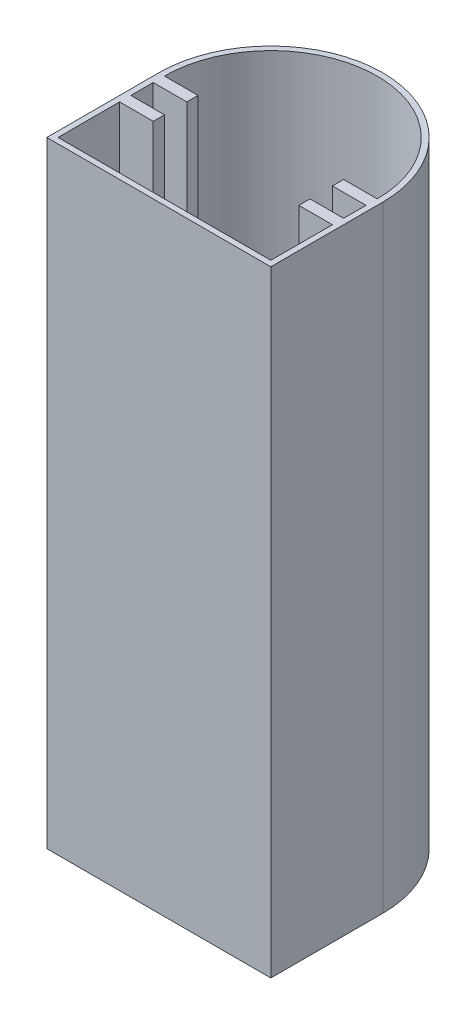
ISO-10303-21;
HEADER;
FILE_DESCRIPTION(('STEP AP214'),'2;1');
FILE_NAME('part.step','',(''),(''),'','','');
FILE_SCHEMA(('AUTOMOTIVE_DESIGN { 1 0 10303 214 1 1 1 1 }'));
ENDSEC;
DATA;
#1=APPLICATION_CONTEXT('core data for automotive mechanical design processes');
#2=APPLICATION_PROTOCOL_DEFINITION('international standard','automotive_design',2000,#1);
#3=PRODUCT_CONTEXT('',#1,'mechanical');
#4=PRODUCT('Part','Part','',(#3));
#5=PRODUCT_RELATED_PRODUCT_CATEGORY('part','',(#4));
#6=PRODUCT_DEFINITION_FORMATION('','',#4);
#7=PRODUCT_DEFINITION_CONTEXT('part definition',#1,'design');
#8=PRODUCT_DEFINITION('design','',#6,#7);
#9=PRODUCT_DEFINITION_SHAPE('','',#8);
#10=(LENGTH_UNIT() NAMED_UNIT(*) SI_UNIT(.MILLI.,.METRE.));
#11=(NAMED_UNIT(*) PLANE_ANGLE_UNIT() SI_UNIT($,.RADIAN.));
#12=(NAMED_UNIT(*) SI_UNIT($,.STERADIAN.) SOLID_ANGLE_UNIT());
#13=UNCERTAINTY_MEASURE_WITH_UNIT(LENGTH_MEASURE(1.E-05),#10,'distance_accuracy_value','');
#14=(GEOMETRIC_REPRESENTATION_CONTEXT(3) GLOBAL_UNCERTAINTY_ASSIGNED_CONTEXT((#13)) GLOBAL_UNIT_ASSIGNED_CONTEXT((#10,
#11,#12)) REPRESENTATION_CONTEXT('',''));
#15=CARTESIAN_POINT('',(0.,0.,0.));
#16=DIRECTION('',(0.,0.,1.));
#17=DIRECTION('',(1.,0.,0.));
#18=AXIS2_PLACEMENT_3D('',#15,#16,#17);
#19=CARTESIAN_POINT('',(-38.8830935251799,110.,1.70773381294964));
#20=DIRECTION('',(0.,0.,-1.));
#21=DIRECTION('',(-1.,0.,0.));
#22=AXIS2_PLACEMENT_3D('',#19,#20,#21);
#23=PLANE('',#22);
#24=DIRECTION('',(1.,0.,0.));
#25=VECTOR('',#24,1.);
#26=CARTESIAN_POINT('',(-38.8830935251799,0.,1.70773381294964));
#27=LINE('',#26,#25);
#28=CARTESIAN_POINT('',(-38.8830935251799,0.,1.70773381294964));
#29=VERTEX_POINT('',#28);
#30=CARTESIAN_POINT('',(1.11690647482014,0.,1.70773381294964));
#31=VERTEX_POINT('',#30);
#32=EDGE_CURVE('E313',#29,#31,#27,.T.);
#33=ORIENTED_EDGE('',*,*,#32,.T.);
#34=DIRECTION('',(0.,-1.,0.));
#35=VECTOR('',#34,1.);
#36=CARTESIAN_POINT('',(1.11690647482014,110.,1.70773381294964));
#37=LINE('',#36,#35);
#38=CARTESIAN_POINT('',(1.11690647482014,110.,1.70773381294964));
#39=VERTEX_POINT('',#38);
#40=EDGE_CURVE('E11',#39,#31,#37,.T.);
#41=ORIENTED_EDGE('',*,*,#40,.F.);
#42=DIRECTION('',(1.,0.,0.));
#43=VECTOR('',#42,1.);
#44=CARTESIAN_POINT('',(-38.8830935251799,110.,1.70773381294964));
#45=LINE('',#44,#43);
#46=CARTESIAN_POINT('',(-38.8830935251799,110.,1.70773381294964));
#47=VERTEX_POINT('',#46);
#48=EDGE_CURVE('E345',#47,#39,#45,.T.);
#49=ORIENTED_EDGE('',*,*,#48,.F.);
#50=DIRECTION('',(0.,-1.,0.));
#51=VECTOR('',#50,1.);
#52=CARTESIAN_POINT('',(-38.8830935251799,110.,1.70773381294964));
#53=LINE('',#52,#51);
#54=EDGE_CURVE('E59',#47,#29,#53,.T.);
#55=ORIENTED_EDGE('',*,*,#54,.T.);
#56=EDGE_LOOP('',(#33,#41,#49,#55));
#57=FACE_BOUND('',#56,.T.);
#58=ADVANCED_FACE('F35',(#57),#23,.F.);
#59=CARTESIAN_POINT('',(1.11690647482014,110.,1.70773381294964));
#60=DIRECTION('',(-1.,0.,0.));
#61=DIRECTION('',(0.,0.,1.));
#62=AXIS2_PLACEMENT_3D('',#59,#60,#61);
#63=PLANE('',#62);
#64=DIRECTION('',(0.,0.,-1.));
#65=VECTOR('',#64,1.);
#66=CARTESIAN_POINT('',(1.11690647482014,0.,1.70773381294964));
#67=LINE('',#66,#65);
#68=CARTESIAN_POINT('',(1.11690647482014,0.,-18.2922661870504));
#69=VERTEX_POINT('',#68);
#70=EDGE_CURVE('E354',#31,#69,#67,.T.);
#71=ORIENTED_EDGE('',*,*,#70,.T.);
#72=DIRECTION('',(0.,-1.,0.));
#73=VECTOR('',#72,1.);
#74=CARTESIAN_POINT('',(1.11690647482014,110.,-18.2922661870504));
#75=LINE('',#74,#73);
#76=CARTESIAN_POINT('',(1.11690647482014,110.,-18.2922661870504));
#77=VERTEX_POINT('',#76);
#78=EDGE_CURVE('E43',#77,#69,#75,.T.);
#79=ORIENTED_EDGE('',*,*,#78,.F.);
#80=DIRECTION('',(0.,0.,-1.));
#81=VECTOR('',#80,1.);
#82=CARTESIAN_POINT('',(1.11690647482014,110.,1.70773381294964));
#83=LINE('',#82,#81);
#84=EDGE_CURVE('E85',#39,#77,#83,.T.);
#85=ORIENTED_EDGE('',*,*,#84,.F.);
#86=ORIENTED_EDGE('',*,*,#40,.T.);
#87=EDGE_LOOP('',(#71,#79,#85,#86));
#88=FACE_BOUND('',#87,.T.);
#89=ADVANCED_FACE('F377',(#88),#63,.F.);
#90=CARTESIAN_POINT('',(-18.8830935251799,110.,-18.2922661870504));
#91=DIRECTION('',(0.,-1.,0.));
#92=DIRECTION('',(0.,0.,-1.));
#93=AXIS2_PLACEMENT_3D('',#90,#91,#92);
#94=CYLINDRICAL_SURFACE('',#93,20.);
#95=CARTESIAN_POINT('',(-18.8830935251799,0.,-18.2922661870504));
#96=DIRECTION('',(0.,1.,0.));
#97=DIRECTION('',(0.,0.,1.));
#98=AXIS2_PLACEMENT_3D('',#95,#96,#97);
#99=CIRCLE('',#98,20.);
#100=CARTESIAN_POINT('',(-38.8830935251799,0.,-18.2922661870504));
#101=VERTEX_POINT('',#100);
#102=EDGE_CURVE('E356',#69,#101,#99,.T.);
#103=ORIENTED_EDGE('',*,*,#102,.T.);
#104=DIRECTION('',(0.,-1.,0.));
#105=VECTOR('',#104,1.);
#106=CARTESIAN_POINT('',(-38.8830935251799,110.,-18.2922661870504));
#107=LINE('',#106,#105);
#108=CARTESIAN_POINT('',(-38.8830935251799,110.,-18.2922661870504));
#109=VERTEX_POINT('',#108);
#110=EDGE_CURVE('E362',#109,#101,#107,.T.);
#111=ORIENTED_EDGE('',*,*,#110,.F.);
#112=CARTESIAN_POINT('',(-18.8830935251799,110.,-18.2922661870504));
#113=DIRECTION('',(0.,1.,0.));
#114=DIRECTION('',(0.,0.,1.));
#115=AXIS2_PLACEMENT_3D('',#112,#113,#114);
#116=CIRCLE('',#115,20.);
#117=EDGE_CURVE('E349',#77,#109,#116,.T.);
#118=ORIENTED_EDGE('',*,*,#117,.F.);
#119=ORIENTED_EDGE('',*,*,#78,.T.);
#120=EDGE_LOOP('',(#103,#111,#118,#119));
#121=FACE_BOUND('',#120,.T.);
#122=ADVANCED_FACE('F368',(#121),#94,.T.);
#123=CARTESIAN_POINT('',(-38.8830935251799,110.,1.70773381294964));
#124=DIRECTION('',(-1.,0.,0.));
#125=DIRECTION('',(0.,0.,1.));
#126=AXIS2_PLACEMENT_3D('',#123,#124,#125);
#127=PLANE('',#126);
#128=CARTESIAN_POINT('',(-38.8830935251799,55.,-4.95893285371703));
#129=DIRECTION('',(-1.,0.,0.));
#130=DIRECTION('',(0.,0.,1.));
#131=AXIS2_PLACEMENT_3D('',#128,#129,#130);
#132=CIRCLE('',#131,2.87500000000001);
#133=CARTESIAN_POINT('',(-38.8830935251799,55.,-2.08393285371702));
#134=VERTEX_POINT('',#133);
#135=EDGE_CURVE('E219',#134,#134,#132,.T.);
#136=ORIENTED_EDGE('',*,*,#135,.F.);
#137=EDGE_LOOP('',(#136));
#138=FACE_BOUND('',#137,.T.);
#139=DIRECTION('',(0.,0.,-1.));
#140=VECTOR('',#139,1.);
#141=CARTESIAN_POINT('',(-38.8830935251799,0.,1.70773381294964));
#142=LINE('',#141,#140);
#143=EDGE_CURVE('E347',#29,#101,#142,.T.);
#144=ORIENTED_EDGE('',*,*,#143,.F.);
#145=ORIENTED_EDGE('',*,*,#54,.F.);
#146=DIRECTION('',(0.,0.,-1.));
#147=VECTOR('',#146,1.);
#148=CARTESIAN_POINT('',(-38.8830935251799,110.,1.70773381294964));
#149=LINE('',#148,#147);
#150=EDGE_CURVE('E351',#47,#109,#149,.T.);
#151=ORIENTED_EDGE('',*,*,#150,.T.);
#152=ORIENTED_EDGE('',*,*,#110,.T.);
#153=EDGE_LOOP('',(#144,#145,#151,#152));
#154=FACE_BOUND('',#153,.T.);
#155=ADVANCED_FACE('F372',(#138,#154),#127,.T.);
#156=CARTESIAN_POINT('',(-18.8830935251799,110.,-18.2922661870504));
#157=DIRECTION('',(0.,1.,0.));
#158=DIRECTION('',(0.,0.,1.));
#159=AXIS2_PLACEMENT_3D('',#156,#157,#158);
#160=PLANE('',#159);
#161=CARTESIAN_POINT('',(-18.8830935251799,110.,-18.2922661870504));
#162=DIRECTION('',(0.,1.,0.));
#163=DIRECTION('',(0.,0.,1.));
#164=AXIS2_PLACEMENT_3D('',#161,#162,#163);
#165=CIRCLE('',#164,19.);
#166=CARTESIAN_POINT('',(0.116906474820141,110.,-18.2922661870504));
#167=VERTEX_POINT('',#166);
#168=CARTESIAN_POINT('',(-37.8830935251799,110.,-18.2922661870504));
#169=VERTEX_POINT('',#168);
#170=EDGE_CURVE('E50',#167,#169,#165,.T.);
#171=ORIENTED_EDGE('',*,*,#170,.F.);
#172=DIRECTION('',(1.,0.,0.));
#173=VECTOR('',#172,1.);
#174=CARTESIAN_POINT('',(0.116906474820141,110.,-18.2922661870504));
#175=LINE('',#174,#173);
#176=CARTESIAN_POINT('',(-5.88309352517986,110.,-18.2922661870504));
#177=VERTEX_POINT('',#176);
#178=EDGE_CURVE('E213',#177,#167,#175,.T.);
#179=ORIENTED_EDGE('',*,*,#178,.F.);
#180=DIRECTION('',(0.,0.,-1.));
#181=VECTOR('',#180,1.);
#182=CARTESIAN_POINT('',(-5.88309352517986,110.,-18.2922661870504));
#183=LINE('',#182,#181);
#184=CARTESIAN_POINT('',(-5.88309352517985,110.,-16.2922661870504));
#185=VERTEX_POINT('',#184);
#186=EDGE_CURVE('E216',#185,#177,#183,.T.);
#187=ORIENTED_EDGE('',*,*,#186,.F.);
#188=DIRECTION('',(-1.,0.,0.));
#189=VECTOR('',#188,1.);
#190=CARTESIAN_POINT('',(-5.88309352517985,110.,-16.2922661870504));
#191=LINE('',#190,#189);
#192=CARTESIAN_POINT('',(0.116906474820142,110.,-16.2922661870504));
#193=VERTEX_POINT('',#192);
#194=EDGE_CURVE('E306',#193,#185,#191,.T.);
#195=ORIENTED_EDGE('',*,*,#194,.F.);
#196=DIRECTION('',(0.,0.,-1.));
#197=VECTOR('',#196,1.);
#198=CARTESIAN_POINT('',(0.116906474820142,110.,-16.2922661870504));
#199=LINE('',#198,#197);
#200=CARTESIAN_POINT('',(0.116906474820143,110.,-12.2922661870504));
#201=VERTEX_POINT('',#200);
#202=EDGE_CURVE('E303',#201,#193,#199,.T.);
#203=ORIENTED_EDGE('',*,*,#202,.F.);
#204=DIRECTION('',(1.,0.,0.));
#205=VECTOR('',#204,1.);
#206=CARTESIAN_POINT('',(0.116906474820143,110.,-12.2922661870504));
#207=LINE('',#206,#205);
#208=CARTESIAN_POINT('',(-5.88309352517986,110.,-12.2922661870504));
#209=VERTEX_POINT('',#208);
#210=EDGE_CURVE('E300',#209,#201,#207,.T.);
#211=ORIENTED_EDGE('',*,*,#210,.F.);
#212=DIRECTION('',(0.,0.,-1.));
#213=VECTOR('',#212,1.);
#214=CARTESIAN_POINT('',(-5.88309352517986,110.,-12.2922661870504));
#215=LINE('',#214,#213);
#216=CARTESIAN_POINT('',(-5.88309352517986,110.,-10.2922661870504));
#217=VERTEX_POINT('',#216);
#218=EDGE_CURVE('E297',#217,#209,#215,.T.);
#219=ORIENTED_EDGE('',*,*,#218,.F.);
#220=DIRECTION('',(-1.,0.,0.));
#221=VECTOR('',#220,1.);
#222=CARTESIAN_POINT('',(-5.88309352517986,110.,-10.2922661870504));
#223=LINE('',#222,#221);
#224=CARTESIAN_POINT('',(0.116906474820143,110.,-10.2922661870504));
#225=VERTEX_POINT('',#224);
#226=EDGE_CURVE('E294',#225,#217,#223,.T.);
#227=ORIENTED_EDGE('',*,*,#226,.F.);
#228=DIRECTION('',(0.,0.,-1.));
#229=VECTOR('',#228,1.);
#230=CARTESIAN_POINT('',(0.116906474820143,110.,-10.2922661870504));
#231=LINE('',#230,#229);
#232=CARTESIAN_POINT('',(0.116906474820145,110.,0.70773381294964));
#233=VERTEX_POINT('',#232);
#234=EDGE_CURVE('E291',#233,#225,#231,.T.);
#235=ORIENTED_EDGE('',*,*,#234,.F.);
#236=DIRECTION('',(1.,0.,0.));
#237=VECTOR('',#236,1.);
#238=CARTESIAN_POINT('',(-37.8830935251799,110.,0.707733812949641));
#239=LINE('',#238,#237);
#240=CARTESIAN_POINT('',(-37.8830935251799,110.,0.707733812949641));
#241=VERTEX_POINT('',#240);
#242=EDGE_CURVE('E288',#241,#233,#239,.T.);
#243=ORIENTED_EDGE('',*,*,#242,.F.);
#244=DIRECTION('',(0.,0.,1.));
#245=VECTOR('',#244,1.);
#246=CARTESIAN_POINT('',(-37.8830935251799,110.,-10.2922661870504));
#247=LINE('',#246,#245);
#248=CARTESIAN_POINT('',(-37.8830935251799,110.,-10.2922661870504));
#249=VERTEX_POINT('',#248);
#250=EDGE_CURVE('E285',#249,#241,#247,.T.);
#251=ORIENTED_EDGE('',*,*,#250,.F.);
#252=DIRECTION('',(-1.,0.,0.));
#253=VECTOR('',#252,1.);
#254=CARTESIAN_POINT('',(-31.8830935251799,110.,-10.2922661870504));
#255=LINE('',#254,#253);
#256=CARTESIAN_POINT('',(-31.8830935251799,110.,-10.2922661870504));
#257=VERTEX_POINT('',#256);
#258=EDGE_CURVE('E282',#257,#249,#255,.T.);
#259=ORIENTED_EDGE('',*,*,#258,.F.);
#260=DIRECTION('',(0.,0.,1.));
#261=VECTOR('',#260,1.);
#262=CARTESIAN_POINT('',(-31.8830935251799,110.,-12.2922661870504));
#263=LINE('',#262,#261);
#264=CARTESIAN_POINT('',(-31.8830935251799,110.,-12.2922661870504));
#265=VERTEX_POINT('',#264);
#266=EDGE_CURVE('E279',#265,#257,#263,.T.);
#267=ORIENTED_EDGE('',*,*,#266,.F.);
#268=DIRECTION('',(1.,0.,0.));
#269=VECTOR('',#268,1.);
#270=CARTESIAN_POINT('',(-37.8830935251799,110.,-12.2922661870504));
#271=LINE('',#270,#269);
#272=CARTESIAN_POINT('',(-37.8830935251799,110.,-12.2922661870504));
#273=VERTEX_POINT('',#272);
#274=EDGE_CURVE('E276',#273,#265,#271,.T.);
#275=ORIENTED_EDGE('',*,*,#274,.F.);
#276=DIRECTION('',(0.,0.,1.));
#277=VECTOR('',#276,1.);
#278=CARTESIAN_POINT('',(-37.8830935251799,110.,-16.2922661870504));
#279=LINE('',#278,#277);
#280=CARTESIAN_POINT('',(-37.8830935251799,110.,-16.2922661870504));
#281=VERTEX_POINT('',#280);
#282=EDGE_CURVE('E273',#281,#273,#279,.T.);
#283=ORIENTED_EDGE('',*,*,#282,.F.);
#284=DIRECTION('',(-1.,0.,0.));
#285=VECTOR('',#284,1.);
#286=CARTESIAN_POINT('',(-31.8830935251799,110.,-16.2922661870504));
#287=LINE('',#286,#285);
#288=CARTESIAN_POINT('',(-31.8830935251799,110.,-16.2922661870504));
#289=VERTEX_POINT('',#288);
#290=EDGE_CURVE('E270',#289,#281,#287,.T.);
#291=ORIENTED_EDGE('',*,*,#290,.F.);
#292=DIRECTION('',(0.,0.,1.));
#293=VECTOR('',#292,1.);
#294=CARTESIAN_POINT('',(-31.8830935251799,110.,-18.2922661870504));
#295=LINE('',#294,#293);
#296=CARTESIAN_POINT('',(-31.8830935251799,110.,-18.2922661870504));
#297=VERTEX_POINT('',#296);
#298=EDGE_CURVE('E267',#297,#289,#295,.T.);
#299=ORIENTED_EDGE('',*,*,#298,.F.);
#300=DIRECTION('',(1.,0.,0.));
#301=VECTOR('',#300,1.);
#302=CARTESIAN_POINT('',(-37.8830935251799,110.,-18.2922661870504));
#303=LINE('',#302,#301);
#304=EDGE_CURVE('E265',#169,#297,#303,.T.);
#305=ORIENTED_EDGE('',*,*,#304,.F.);
#306=EDGE_LOOP('',(#171,#179,#187,#195,#203,#211,#219,#227,#235,#243,#251,#259,#267,#275,#283,
#291,#299,#305));
#307=FACE_BOUND('',#306,.T.);
#308=ORIENTED_EDGE('',*,*,#48,.T.);
#309=ORIENTED_EDGE('',*,*,#84,.T.);
#310=ORIENTED_EDGE('',*,*,#117,.T.);
#311=ORIENTED_EDGE('',*,*,#150,.F.);
#312=EDGE_LOOP('',(#308,#309,#310,#311));
#313=FACE_BOUND('',#312,.T.);
#314=ADVANCED_FACE('F375',(#307,#313),#160,.T.);
#315=CARTESIAN_POINT('',(-18.8830935251799,0.,-18.2922661870504));
#316=DIRECTION('',(0.,1.,0.));
#317=DIRECTION('',(0.,0.,1.));
#318=AXIS2_PLACEMENT_3D('',#315,#316,#317);
#319=PLANE('',#318);
#320=ORIENTED_EDGE('',*,*,#32,.F.);
#321=ORIENTED_EDGE('',*,*,#143,.T.);
#322=ORIENTED_EDGE('',*,*,#102,.F.);
#323=ORIENTED_EDGE('',*,*,#70,.F.);
#324=EDGE_LOOP('',(#320,#321,#322,#323));
#325=FACE_BOUND('',#324,.T.);
#326=ADVANCED_FACE('F371',(#325),#319,.F.);
#327=CARTESIAN_POINT('',(-18.8830935251799,1.,-18.2922661870504));
#328=DIRECTION('',(0.,1.,0.));
#329=DIRECTION('',(0.,0.,1.));
#330=AXIS2_PLACEMENT_3D('',#327,#328,#329);
#331=CYLINDRICAL_SURFACE('',#330,19.);
#332=ORIENTED_EDGE('',*,*,#170,.T.);
#333=DIRECTION('',(0.,1.,0.));
#334=VECTOR('',#333,1.);
#335=CARTESIAN_POINT('',(-37.8830935251799,1.,-18.2922661870504));
#336=LINE('',#335,#334);
#337=CARTESIAN_POINT('',(-37.8830935251799,1.,-18.2922661870504));
#338=VERTEX_POINT('',#337);
#339=EDGE_CURVE('E190',#338,#169,#336,.T.);
#340=ORIENTED_EDGE('',*,*,#339,.F.);
#341=CARTESIAN_POINT('',(-18.8830935251799,1.,-18.2922661870504));
#342=DIRECTION('',(0.,1.,0.));
#343=DIRECTION('',(0.,0.,1.));
#344=AXIS2_PLACEMENT_3D('',#341,#342,#343);
#345=CIRCLE('',#344,19.);
#346=CARTESIAN_POINT('',(0.116906474820141,1.,-18.2922661870504));
#347=VERTEX_POINT('',#346);
#348=EDGE_CURVE('E194',#347,#338,#345,.T.);
#349=ORIENTED_EDGE('',*,*,#348,.F.);
#350=DIRECTION('',(0.,1.,0.));
#351=VECTOR('',#350,1.);
#352=CARTESIAN_POINT('',(0.116906474820141,1.,-18.2922661870504));
#353=LINE('',#352,#351);
#354=EDGE_CURVE('E311',#347,#167,#353,.T.);
#355=ORIENTED_EDGE('',*,*,#354,.T.);
#356=EDGE_LOOP('',(#332,#340,#349,#355));
#357=FACE_BOUND('',#356,.T.);
#358=ADVANCED_FACE('F192',(#357),#331,.F.);
#359=CARTESIAN_POINT('',(0.116906474820141,1.,-18.2922661870504));
#360=DIRECTION('',(0.,0.,1.));
#361=DIRECTION('',(1.,0.,0.));
#362=AXIS2_PLACEMENT_3D('',#359,#360,#361);
#363=PLANE('',#362);
#364=ORIENTED_EDGE('',*,*,#178,.T.);
#365=ORIENTED_EDGE('',*,*,#354,.F.);
#366=DIRECTION('',(1.,0.,0.));
#367=VECTOR('',#366,1.);
#368=CARTESIAN_POINT('',(0.116906474820141,1.,-18.2922661870504));
#369=LINE('',#368,#367);
#370=CARTESIAN_POINT('',(-5.88309352517986,1.,-18.2922661870504));
#371=VERTEX_POINT('',#370);
#372=EDGE_CURVE('E200',#371,#347,#369,.T.);
#373=ORIENTED_EDGE('',*,*,#372,.F.);
#374=DIRECTION('',(0.,1.,0.));
#375=VECTOR('',#374,1.);
#376=CARTESIAN_POINT('',(-5.88309352517986,1.,-18.2922661870504));
#377=LINE('',#376,#375);
#378=EDGE_CURVE('E314',#371,#177,#377,.T.);
#379=ORIENTED_EDGE('',*,*,#378,.T.);
#380=EDGE_LOOP('',(#364,#365,#373,#379));
#381=FACE_BOUND('',#380,.T.);
#382=ADVANCED_FACE('F395',(#381),#363,.F.);
#383=CARTESIAN_POINT('',(-5.88309352517986,1.,-18.2922661870504));
#384=DIRECTION('',(1.,0.,0.));
#385=DIRECTION('',(0.,0.,-1.));
#386=AXIS2_PLACEMENT_3D('',#383,#384,#385);
#387=PLANE('',#386);
#388=ORIENTED_EDGE('',*,*,#186,.T.);
#389=ORIENTED_EDGE('',*,*,#378,.F.);
#390=DIRECTION('',(0.,0.,-1.));
#391=VECTOR('',#390,1.);
#392=CARTESIAN_POINT('',(-5.88309352517986,1.,-18.2922661870504));
#393=LINE('',#392,#391);
#394=CARTESIAN_POINT('',(-5.88309352517985,1.,-16.2922661870504));
#395=VERTEX_POINT('',#394);
#396=EDGE_CURVE('E261',#395,#371,#393,.T.);
#397=ORIENTED_EDGE('',*,*,#396,.F.);
#398=DIRECTION('',(0.,1.,0.));
#399=VECTOR('',#398,1.);
#400=CARTESIAN_POINT('',(-5.88309352517985,1.,-16.2922661870504));
#401=LINE('',#400,#399);
#402=EDGE_CURVE('E316',#395,#185,#401,.T.);
#403=ORIENTED_EDGE('',*,*,#402,.T.);
#404=EDGE_LOOP('',(#388,#389,#397,#403));
#405=FACE_BOUND('',#404,.T.);
#406=ADVANCED_FACE('F453',(#405),#387,.F.);
#407=CARTESIAN_POINT('',(-5.88309352517985,1.,-16.2922661870504));
#408=DIRECTION('',(0.,0.,-1.));
#409=DIRECTION('',(-1.,0.,0.));
#410=AXIS2_PLACEMENT_3D('',#407,#408,#409);
#411=PLANE('',#410);
#412=ORIENTED_EDGE('',*,*,#194,.T.);
#413=ORIENTED_EDGE('',*,*,#402,.F.);
#414=DIRECTION('',(-1.,0.,0.));
#415=VECTOR('',#414,1.);
#416=CARTESIAN_POINT('',(-5.88309352517985,1.,-16.2922661870504));
#417=LINE('',#416,#415);
#418=CARTESIAN_POINT('',(0.116906474820142,1.,-16.2922661870504));
#419=VERTEX_POINT('',#418);
#420=EDGE_CURVE('E258',#419,#395,#417,.T.);
#421=ORIENTED_EDGE('',*,*,#420,.F.);
#422=DIRECTION('',(0.,1.,0.));
#423=VECTOR('',#422,1.);
#424=CARTESIAN_POINT('',(0.116906474820142,1.,-16.2922661870504));
#425=LINE('',#424,#423);
#426=EDGE_CURVE('E318',#419,#193,#425,.T.);
#427=ORIENTED_EDGE('',*,*,#426,.T.);
#428=EDGE_LOOP('',(#412,#413,#421,#427));
#429=FACE_BOUND('',#428,.T.);
#430=ADVANCED_FACE('F449',(#429),#411,.F.);
#431=CARTESIAN_POINT('',(0.116906474820142,1.,-16.2922661870504));
#432=DIRECTION('',(1.,0.,0.));
#433=DIRECTION('',(0.,0.,-1.));
#434=AXIS2_PLACEMENT_3D('',#431,#432,#433);
#435=PLANE('',#434);
#436=ORIENTED_EDGE('',*,*,#202,.T.);
#437=ORIENTED_EDGE('',*,*,#426,.F.);
#438=DIRECTION('',(0.,0.,-1.));
#439=VECTOR('',#438,1.);
#440=CARTESIAN_POINT('',(0.116906474820142,1.,-16.2922661870504));
#441=LINE('',#440,#439);
#442=CARTESIAN_POINT('',(0.116906474820143,1.,-12.2922661870504));
#443=VERTEX_POINT('',#442);
#444=EDGE_CURVE('E255',#443,#419,#441,.T.);
#445=ORIENTED_EDGE('',*,*,#444,.F.);
#446=DIRECTION('',(0.,1.,0.));
#447=VECTOR('',#446,1.);
#448=CARTESIAN_POINT('',(0.116906474820143,1.,-12.2922661870504));
#449=LINE('',#448,#447);
#450=EDGE_CURVE('E320',#443,#201,#449,.T.);
#451=ORIENTED_EDGE('',*,*,#450,.T.);
#452=EDGE_LOOP('',(#436,#437,#445,#451));
#453=FACE_BOUND('',#452,.T.);
#454=ADVANCED_FACE('F445',(#453),#435,.F.);
#455=CARTESIAN_POINT('',(0.116906474820143,1.,-12.2922661870504));
#456=DIRECTION('',(0.,0.,1.));
#457=DIRECTION('',(1.,0.,0.));
#458=AXIS2_PLACEMENT_3D('',#455,#456,#457);
#459=PLANE('',#458);
#460=ORIENTED_EDGE('',*,*,#210,.T.);
#461=ORIENTED_EDGE('',*,*,#450,.F.);
#462=DIRECTION('',(1.,0.,0.));
#463=VECTOR('',#462,1.);
#464=CARTESIAN_POINT('',(0.116906474820143,1.,-12.2922661870504));
#465=LINE('',#464,#463);
#466=CARTESIAN_POINT('',(-5.88309352517986,1.,-12.2922661870504));
#467=VERTEX_POINT('',#466);
#468=EDGE_CURVE('E252',#467,#443,#465,.T.);
#469=ORIENTED_EDGE('',*,*,#468,.F.);
#470=DIRECTION('',(0.,1.,0.));
#471=VECTOR('',#470,1.);
#472=CARTESIAN_POINT('',(-5.88309352517986,1.,-12.2922661870504));
#473=LINE('',#472,#471);
#474=EDGE_CURVE('E322',#467,#209,#473,.T.);
#475=ORIENTED_EDGE('',*,*,#474,.T.);
#476=EDGE_LOOP('',(#460,#461,#469,#475));
#477=FACE_BOUND('',#476,.T.);
#478=ADVANCED_FACE('F441',(#477),#459,.F.);
#479=CARTESIAN_POINT('',(-5.88309352517986,1.,-12.2922661870504));
#480=DIRECTION('',(1.,0.,0.));
#481=DIRECTION('',(0.,0.,-1.));
#482=AXIS2_PLACEMENT_3D('',#479,#480,#481);
#483=PLANE('',#482);
#484=ORIENTED_EDGE('',*,*,#218,.T.);
#485=ORIENTED_EDGE('',*,*,#474,.F.);
#486=DIRECTION('',(0.,0.,-1.));
#487=VECTOR('',#486,1.);
#488=CARTESIAN_POINT('',(-5.88309352517986,1.,-12.2922661870504));
#489=LINE('',#488,#487);
#490=CARTESIAN_POINT('',(-5.88309352517986,1.,-10.2922661870504));
#491=VERTEX_POINT('',#490);
#492=EDGE_CURVE('E249',#491,#467,#489,.T.);
#493=ORIENTED_EDGE('',*,*,#492,.F.);
#494=DIRECTION('',(0.,1.,0.));
#495=VECTOR('',#494,1.);
#496=CARTESIAN_POINT('',(-5.88309352517986,1.,-10.2922661870504));
#497=LINE('',#496,#495);
#498=EDGE_CURVE('E324',#491,#217,#497,.T.);
#499=ORIENTED_EDGE('',*,*,#498,.T.);
#500=EDGE_LOOP('',(#484,#485,#493,#499));
#501=FACE_BOUND('',#500,.T.);
#502=ADVANCED_FACE('F437',(#501),#483,.F.);
#503=CARTESIAN_POINT('',(-5.88309352517986,1.,-10.2922661870504));
#504=DIRECTION('',(0.,0.,-1.));
#505=DIRECTION('',(-1.,0.,0.));
#506=AXIS2_PLACEMENT_3D('',#503,#504,#505);
#507=PLANE('',#506);
#508=ORIENTED_EDGE('',*,*,#226,.T.);
#509=ORIENTED_EDGE('',*,*,#498,.F.);
#510=DIRECTION('',(-1.,0.,0.));
#511=VECTOR('',#510,1.);
#512=CARTESIAN_POINT('',(-5.88309352517986,1.,-10.2922661870504));
#513=LINE('',#512,#511);
#514=CARTESIAN_POINT('',(0.116906474820143,1.,-10.2922661870504));
#515=VERTEX_POINT('',#514);
#516=EDGE_CURVE('E246',#515,#491,#513,.T.);
#517=ORIENTED_EDGE('',*,*,#516,.F.);
#518=DIRECTION('',(0.,1.,0.));
#519=VECTOR('',#518,1.);
#520=CARTESIAN_POINT('',(0.116906474820143,1.,-10.2922661870504));
#521=LINE('',#520,#519);
#522=EDGE_CURVE('E326',#515,#225,#521,.T.);
#523=ORIENTED_EDGE('',*,*,#522,.T.);
#524=EDGE_LOOP('',(#508,#509,#517,#523));
#525=FACE_BOUND('',#524,.T.);
#526=ADVANCED_FACE('F433',(#525),#507,.F.);
#527=CARTESIAN_POINT('',(0.116906474820143,1.,-10.2922661870504));
#528=DIRECTION('',(1.,0.,0.));
#529=DIRECTION('',(0.,0.,-1.));
#530=AXIS2_PLACEMENT_3D('',#527,#528,#529);
#531=PLANE('',#530);
#532=ORIENTED_EDGE('',*,*,#234,.T.);
#533=ORIENTED_EDGE('',*,*,#522,.F.);
#534=DIRECTION('',(0.,0.,-1.));
#535=VECTOR('',#534,1.);
#536=CARTESIAN_POINT('',(0.116906474820143,1.,-10.2922661870504));
#537=LINE('',#536,#535);
#538=CARTESIAN_POINT('',(0.116906474820145,1.,0.70773381294964));
#539=VERTEX_POINT('',#538);
#540=EDGE_CURVE('E243',#539,#515,#537,.T.);
#541=ORIENTED_EDGE('',*,*,#540,.F.);
#542=DIRECTION('',(0.,1.,0.));
#543=VECTOR('',#542,1.);
#544=CARTESIAN_POINT('',(0.116906474820145,1.,0.70773381294964));
#545=LINE('',#544,#543);
#546=EDGE_CURVE('E328',#539,#233,#545,.T.);
#547=ORIENTED_EDGE('',*,*,#546,.T.);
#548=EDGE_LOOP('',(#532,#533,#541,#547));
#549=FACE_BOUND('',#548,.T.);
#550=ADVANCED_FACE('F429',(#549),#531,.F.);
#551=CARTESIAN_POINT('',(-37.8830935251799,1.,0.707733812949641));
#552=DIRECTION('',(0.,0.,1.));
#553=DIRECTION('',(1.,0.,0.));
#554=AXIS2_PLACEMENT_3D('',#551,#552,#553);
#555=PLANE('',#554);
#556=ORIENTED_EDGE('',*,*,#242,.T.);
#557=ORIENTED_EDGE('',*,*,#546,.F.);
#558=DIRECTION('',(1.,0.,0.));
#559=VECTOR('',#558,1.);
#560=CARTESIAN_POINT('',(-37.8830935251799,1.,0.707733812949641));
#561=LINE('',#560,#559);
#562=CARTESIAN_POINT('',(-37.8830935251799,1.,0.707733812949641));
#563=VERTEX_POINT('',#562);
#564=EDGE_CURVE('E240',#563,#539,#561,.T.);
#565=ORIENTED_EDGE('',*,*,#564,.F.);
#566=DIRECTION('',(0.,1.,0.));
#567=VECTOR('',#566,1.);
#568=CARTESIAN_POINT('',(-37.8830935251799,1.,0.707733812949641));
#569=LINE('',#568,#567);
#570=EDGE_CURVE('E330',#563,#241,#569,.T.);
#571=ORIENTED_EDGE('',*,*,#570,.T.);
#572=EDGE_LOOP('',(#556,#557,#565,#571));
#573=FACE_BOUND('',#572,.T.);
#574=ADVANCED_FACE('F425',(#573),#555,.F.);
#575=CARTESIAN_POINT('',(-37.8830935251799,1.,-10.2922661870504));
#576=DIRECTION('',(-1.,0.,0.));
#577=DIRECTION('',(0.,0.,1.));
#578=AXIS2_PLACEMENT_3D('',#575,#576,#577);
#579=PLANE('',#578);
#580=CARTESIAN_POINT('',(-37.8830935251799,55.,-4.95893285371703));
#581=DIRECTION('',(-1.,0.,0.));
#582=DIRECTION('',(0.,0.,1.));
#583=AXIS2_PLACEMENT_3D('',#580,#581,#582);
#584=CIRCLE('',#583,2.87500000000001);
#585=CARTESIAN_POINT('',(-37.8830935251799,55.,-2.08393285371702));
#586=VERTEX_POINT('',#585);
#587=EDGE_CURVE('E38',#586,#586,#584,.T.);
#588=ORIENTED_EDGE('',*,*,#587,.T.);
#589=EDGE_LOOP('',(#588));
#590=FACE_BOUND('',#589,.T.);
#591=ORIENTED_EDGE('',*,*,#250,.T.);
#592=ORIENTED_EDGE('',*,*,#570,.F.);
#593=DIRECTION('',(0.,0.,1.));
#594=VECTOR('',#593,1.);
#595=CARTESIAN_POINT('',(-37.8830935251799,1.,-10.2922661870504));
#596=LINE('',#595,#594);
#597=CARTESIAN_POINT('',(-37.8830935251799,1.,-10.2922661870504));
#598=VERTEX_POINT('',#597);
#599=EDGE_CURVE('E237',#598,#563,#596,.T.);
#600=ORIENTED_EDGE('',*,*,#599,.F.);
#601=DIRECTION('',(0.,1.,0.));
#602=VECTOR('',#601,1.);
#603=CARTESIAN_POINT('',(-37.8830935251799,1.,-10.2922661870504));
#604=LINE('',#603,#602);
#605=EDGE_CURVE('E332',#598,#249,#604,.T.);
#606=ORIENTED_EDGE('',*,*,#605,.T.);
#607=EDGE_LOOP('',(#591,#592,#600,#606));
#608=FACE_BOUND('',#607,.T.);
#609=ADVANCED_FACE('F421',(#590,#608),#579,.F.);
#610=CARTESIAN_POINT('',(-31.8830935251799,1.,-10.2922661870504));
#611=DIRECTION('',(0.,0.,-1.));
#612=DIRECTION('',(-1.,0.,0.));
#613=AXIS2_PLACEMENT_3D('',#610,#611,#612);
#614=PLANE('',#613);
#615=ORIENTED_EDGE('',*,*,#258,.T.);
#616=ORIENTED_EDGE('',*,*,#605,.F.);
#617=DIRECTION('',(-1.,0.,0.));
#618=VECTOR('',#617,1.);
#619=CARTESIAN_POINT('',(-31.8830935251799,1.,-10.2922661870504));
#620=LINE('',#619,#618);
#621=CARTESIAN_POINT('',(-31.8830935251799,1.,-10.2922661870504));
#622=VERTEX_POINT('',#621);
#623=EDGE_CURVE('E234',#622,#598,#620,.T.);
#624=ORIENTED_EDGE('',*,*,#623,.F.);
#625=DIRECTION('',(0.,1.,0.));
#626=VECTOR('',#625,1.);
#627=CARTESIAN_POINT('',(-31.8830935251799,1.,-10.2922661870504));
#628=LINE('',#627,#626);
#629=EDGE_CURVE('E334',#622,#257,#628,.T.);
#630=ORIENTED_EDGE('',*,*,#629,.T.);
#631=EDGE_LOOP('',(#615,#616,#624,#630));
#632=FACE_BOUND('',#631,.T.);
#633=ADVANCED_FACE('F417',(#632),#614,.F.);
#634=CARTESIAN_POINT('',(-31.8830935251799,1.,-12.2922661870504));
#635=DIRECTION('',(-1.,0.,0.));
#636=DIRECTION('',(0.,0.,1.));
#637=AXIS2_PLACEMENT_3D('',#634,#635,#636);
#638=PLANE('',#637);
#639=ORIENTED_EDGE('',*,*,#266,.T.);
#640=ORIENTED_EDGE('',*,*,#629,.F.);
#641=DIRECTION('',(0.,0.,1.));
#642=VECTOR('',#641,1.);
#643=CARTESIAN_POINT('',(-31.8830935251799,1.,-12.2922661870504));
#644=LINE('',#643,#642);
#645=CARTESIAN_POINT('',(-31.8830935251799,1.,-12.2922661870504));
#646=VERTEX_POINT('',#645);
#647=EDGE_CURVE('E231',#646,#622,#644,.T.);
#648=ORIENTED_EDGE('',*,*,#647,.F.);
#649=DIRECTION('',(0.,1.,0.));
#650=VECTOR('',#649,1.);
#651=CARTESIAN_POINT('',(-31.8830935251799,1.,-12.2922661870504));
#652=LINE('',#651,#650);
#653=EDGE_CURVE('E336',#646,#265,#652,.T.);
#654=ORIENTED_EDGE('',*,*,#653,.T.);
#655=EDGE_LOOP('',(#639,#640,#648,#654));
#656=FACE_BOUND('',#655,.T.);
#657=ADVANCED_FACE('F413',(#656),#638,.F.);
#658=CARTESIAN_POINT('',(-37.8830935251799,1.,-12.2922661870504));
#659=DIRECTION('',(0.,0.,1.));
#660=DIRECTION('',(1.,0.,0.));
#661=AXIS2_PLACEMENT_3D('',#658,#659,#660);
#662=PLANE('',#661);
#663=ORIENTED_EDGE('',*,*,#274,.T.);
#664=ORIENTED_EDGE('',*,*,#653,.F.);
#665=DIRECTION('',(1.,0.,0.));
#666=VECTOR('',#665,1.);
#667=CARTESIAN_POINT('',(-37.8830935251799,1.,-12.2922661870504));
#668=LINE('',#667,#666);
#669=CARTESIAN_POINT('',(-37.8830935251799,1.,-12.2922661870504));
#670=VERTEX_POINT('',#669);
#671=EDGE_CURVE('E228',#670,#646,#668,.T.);
#672=ORIENTED_EDGE('',*,*,#671,.F.);
#673=DIRECTION('',(0.,1.,0.));
#674=VECTOR('',#673,1.);
#675=CARTESIAN_POINT('',(-37.8830935251799,1.,-12.2922661870504));
#676=LINE('',#675,#674);
#677=EDGE_CURVE('E338',#670,#273,#676,.T.);
#678=ORIENTED_EDGE('',*,*,#677,.T.);
#679=EDGE_LOOP('',(#663,#664,#672,#678));
#680=FACE_BOUND('',#679,.T.);
#681=ADVANCED_FACE('F409',(#680),#662,.F.);
#682=CARTESIAN_POINT('',(-37.8830935251799,1.,-16.2922661870504));
#683=DIRECTION('',(-1.,0.,0.));
#684=DIRECTION('',(0.,0.,1.));
#685=AXIS2_PLACEMENT_3D('',#682,#683,#684);
#686=PLANE('',#685);
#687=ORIENTED_EDGE('',*,*,#282,.T.);
#688=ORIENTED_EDGE('',*,*,#677,.F.);
#689=DIRECTION('',(0.,0.,1.));
#690=VECTOR('',#689,1.);
#691=CARTESIAN_POINT('',(-37.8830935251799,1.,-16.2922661870504));
#692=LINE('',#691,#690);
#693=CARTESIAN_POINT('',(-37.8830935251799,1.,-16.2922661870504));
#694=VERTEX_POINT('',#693);
#695=EDGE_CURVE('E225',#694,#670,#692,.T.);
#696=ORIENTED_EDGE('',*,*,#695,.F.);
#697=DIRECTION('',(0.,1.,0.));
#698=VECTOR('',#697,1.);
#699=CARTESIAN_POINT('',(-37.8830935251799,1.,-16.2922661870504));
#700=LINE('',#699,#698);
#701=EDGE_CURVE('E340',#694,#281,#700,.T.);
#702=ORIENTED_EDGE('',*,*,#701,.T.);
#703=EDGE_LOOP('',(#687,#688,#696,#702));
#704=FACE_BOUND('',#703,.T.);
#705=ADVANCED_FACE('F405',(#704),#686,.F.);
#706=CARTESIAN_POINT('',(-31.8830935251799,1.,-16.2922661870504));
#707=DIRECTION('',(0.,0.,-1.));
#708=DIRECTION('',(-1.,0.,0.));
#709=AXIS2_PLACEMENT_3D('',#706,#707,#708);
#710=PLANE('',#709);
#711=ORIENTED_EDGE('',*,*,#290,.T.);
#712=ORIENTED_EDGE('',*,*,#701,.F.);
#713=DIRECTION('',(-1.,0.,0.));
#714=VECTOR('',#713,1.);
#715=CARTESIAN_POINT('',(-31.8830935251799,1.,-16.2922661870504));
#716=LINE('',#715,#714);
#717=CARTESIAN_POINT('',(-31.8830935251799,1.,-16.2922661870504));
#718=VERTEX_POINT('',#717);
#719=EDGE_CURVE('E222',#718,#694,#716,.T.);
#720=ORIENTED_EDGE('',*,*,#719,.F.);
#721=DIRECTION('',(0.,1.,0.));
#722=VECTOR('',#721,1.);
#723=CARTESIAN_POINT('',(-31.8830935251799,1.,-16.2922661870504));
#724=LINE('',#723,#722);
#725=EDGE_CURVE('E342',#718,#289,#724,.T.);
#726=ORIENTED_EDGE('',*,*,#725,.T.);
#727=EDGE_LOOP('',(#711,#712,#720,#726));
#728=FACE_BOUND('',#727,.T.);
#729=ADVANCED_FACE('F401',(#728),#710,.F.);
#730=CARTESIAN_POINT('',(-31.8830935251799,1.,-18.2922661870504));
#731=DIRECTION('',(-1.,0.,0.));
#732=DIRECTION('',(0.,0.,1.));
#733=AXIS2_PLACEMENT_3D('',#730,#731,#732);
#734=PLANE('',#733);
#735=ORIENTED_EDGE('',*,*,#298,.T.);
#736=ORIENTED_EDGE('',*,*,#725,.F.);
#737=DIRECTION('',(0.,0.,1.));
#738=VECTOR('',#737,1.);
#739=CARTESIAN_POINT('',(-31.8830935251799,1.,-18.2922661870504));
#740=LINE('',#739,#738);
#741=CARTESIAN_POINT('',(-31.8830935251799,1.,-18.2922661870504));
#742=VERTEX_POINT('',#741);
#743=EDGE_CURVE('E208',#742,#718,#740,.T.);
#744=ORIENTED_EDGE('',*,*,#743,.F.);
#745=DIRECTION('',(0.,1.,0.));
#746=VECTOR('',#745,1.);
#747=CARTESIAN_POINT('',(-31.8830935251799,1.,-18.2922661870504));
#748=LINE('',#747,#746);
#749=EDGE_CURVE('E199',#742,#297,#748,.T.);
#750=ORIENTED_EDGE('',*,*,#749,.T.);
#751=EDGE_LOOP('',(#735,#736,#744,#750));
#752=FACE_BOUND('',#751,.T.);
#753=ADVANCED_FACE('F398',(#752),#734,.F.);
#754=CARTESIAN_POINT('',(-37.8830935251799,1.,-18.2922661870504));
#755=DIRECTION('',(0.,0.,1.));
#756=DIRECTION('',(1.,0.,0.));
#757=AXIS2_PLACEMENT_3D('',#754,#755,#756);
#758=PLANE('',#757);
#759=ORIENTED_EDGE('',*,*,#304,.T.);
#760=ORIENTED_EDGE('',*,*,#749,.F.);
#761=DIRECTION('',(1.,0.,0.));
#762=VECTOR('',#761,1.);
#763=CARTESIAN_POINT('',(-37.8830935251799,1.,-18.2922661870504));
#764=LINE('',#763,#762);
#765=EDGE_CURVE('E203',#338,#742,#764,.T.);
#766=ORIENTED_EDGE('',*,*,#765,.F.);
#767=ORIENTED_EDGE('',*,*,#339,.T.);
#768=EDGE_LOOP('',(#759,#760,#766,#767));
#769=FACE_BOUND('',#768,.T.);
#770=ADVANCED_FACE('F204',(#769),#758,.F.);
#771=CARTESIAN_POINT('',(-18.8830935251799,1.,-18.2922661870504));
#772=DIRECTION('',(0.,1.,0.));
#773=DIRECTION('',(0.,0.,1.));
#774=AXIS2_PLACEMENT_3D('',#771,#772,#773);
#775=PLANE('',#774);
#776=ORIENTED_EDGE('',*,*,#348,.T.);
#777=ORIENTED_EDGE('',*,*,#765,.T.);
#778=ORIENTED_EDGE('',*,*,#743,.T.);
#779=ORIENTED_EDGE('',*,*,#719,.T.);
#780=ORIENTED_EDGE('',*,*,#695,.T.);
#781=ORIENTED_EDGE('',*,*,#671,.T.);
#782=ORIENTED_EDGE('',*,*,#647,.T.);
#783=ORIENTED_EDGE('',*,*,#623,.T.);
#784=ORIENTED_EDGE('',*,*,#599,.T.);
#785=ORIENTED_EDGE('',*,*,#564,.T.);
#786=ORIENTED_EDGE('',*,*,#540,.T.);
#787=ORIENTED_EDGE('',*,*,#516,.T.);
#788=ORIENTED_EDGE('',*,*,#492,.T.);
#789=ORIENTED_EDGE('',*,*,#468,.T.);
#790=ORIENTED_EDGE('',*,*,#444,.T.);
#791=ORIENTED_EDGE('',*,*,#420,.T.);
#792=ORIENTED_EDGE('',*,*,#396,.T.);
#793=ORIENTED_EDGE('',*,*,#372,.T.);
#794=EDGE_LOOP('',(#776,#777,#778,#779,#780,#781,#782,#783,#784,#785,#786,#787,#788,#789,#790,
#791,#792,#793));
#795=FACE_BOUND('',#794,.T.);
#796=ADVANCED_FACE('F210',(#795),#775,.T.);
#797=CARTESIAN_POINT('',(-33.8830935251799,55.,-4.95893285371703));
#798=DIRECTION('',(-1.,0.,0.));
#799=DIRECTION('',(0.,0.,1.));
#800=AXIS2_PLACEMENT_3D('',#797,#798,#799);
#801=CYLINDRICAL_SURFACE('',#800,2.87500000000001);
#802=ORIENTED_EDGE('',*,*,#135,.T.);
#803=EDGE_LOOP('',(#802));
#804=FACE_BOUND('',#803,.T.);
#805=ORIENTED_EDGE('',*,*,#587,.F.);
#806=EDGE_LOOP('',(#805));
#807=FACE_BOUND('',#806,.T.);
#808=ADVANCED_FACE('F463',(#804,#807),#801,.F.);
#809=CLOSED_SHELL('',(#58,#89,#122,#155,#314,#326,#358,#382,#406,#430,#454,#478,#502,#526,#550,
#574,#609,#633,#657,#681,#705,#729,#753,#770,#796,#808));
#810=MANIFOLD_SOLID_BREP('B2',#809);
#811=ADVANCED_BREP_SHAPE_REPRESENTATION('',(#18,#810),#14);
#812=SHAPE_DEFINITION_REPRESENTATION(#9,#811);
ENDSEC;
END-ISO-10303-21;
